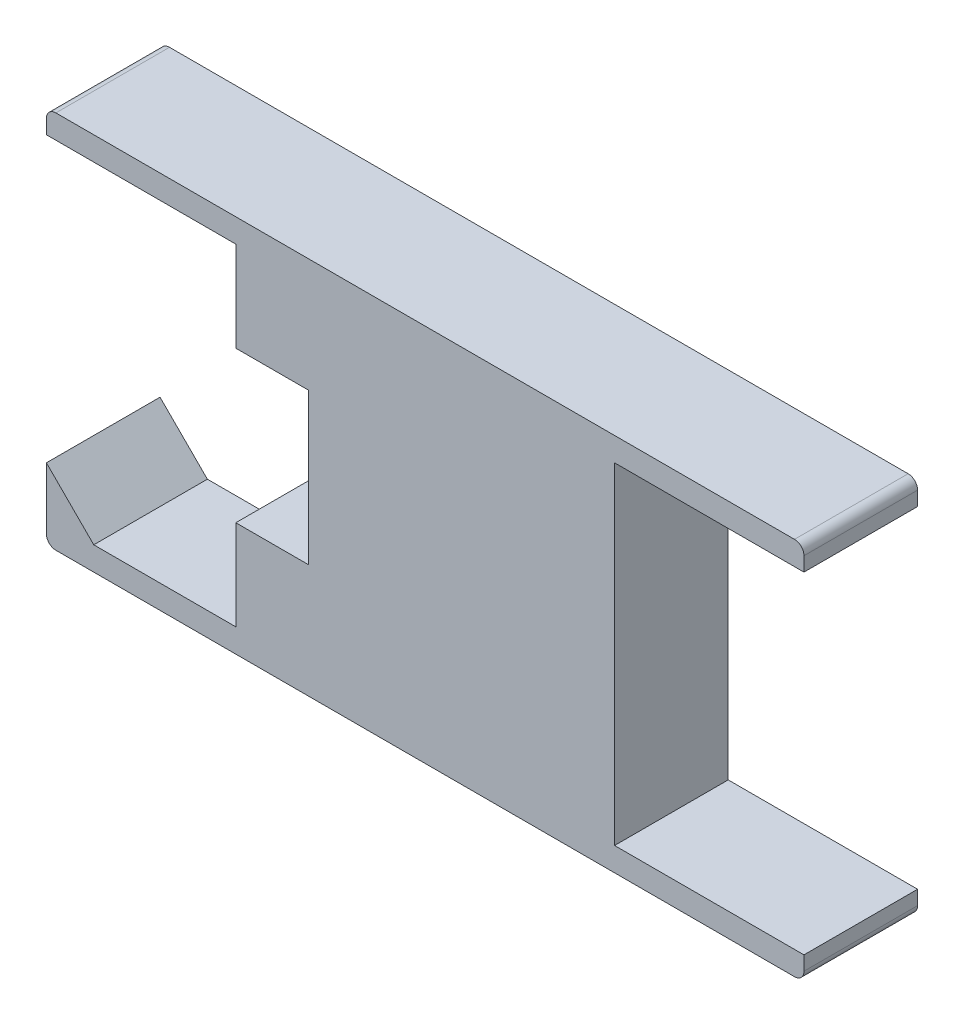
ISO-10303-21;
HEADER;
FILE_DESCRIPTION(('STEP AP214'),'2;1');
FILE_NAME('part.step','',(''),(''),'','','');
FILE_SCHEMA(('AUTOMOTIVE_DESIGN { 1 0 10303 214 1 1 1 1 }'));
ENDSEC;
DATA;
#1=APPLICATION_CONTEXT('core data for automotive mechanical design processes');
#2=APPLICATION_PROTOCOL_DEFINITION('international standard','automotive_design',2000,#1);
#3=PRODUCT_CONTEXT('',#1,'mechanical');
#4=PRODUCT('Part','Part','',(#3));
#5=PRODUCT_RELATED_PRODUCT_CATEGORY('part','',(#4));
#6=PRODUCT_DEFINITION_FORMATION('','',#4);
#7=PRODUCT_DEFINITION_CONTEXT('part definition',#1,'design');
#8=PRODUCT_DEFINITION('design','',#6,#7);
#9=PRODUCT_DEFINITION_SHAPE('','',#8);
#10=(LENGTH_UNIT() NAMED_UNIT(*) SI_UNIT(.MILLI.,.METRE.));
#11=(NAMED_UNIT(*) PLANE_ANGLE_UNIT() SI_UNIT($,.RADIAN.));
#12=(NAMED_UNIT(*) SI_UNIT($,.STERADIAN.) SOLID_ANGLE_UNIT());
#13=UNCERTAINTY_MEASURE_WITH_UNIT(LENGTH_MEASURE(1.E-05),#10,'distance_accuracy_value','');
#14=(GEOMETRIC_REPRESENTATION_CONTEXT(3) GLOBAL_UNCERTAINTY_ASSIGNED_CONTEXT((#13)) GLOBAL_UNIT_ASSIGNED_CONTEXT((#10,
#11,#12)) REPRESENTATION_CONTEXT('',''));
#15=CARTESIAN_POINT('',(0.,0.,0.));
#16=DIRECTION('',(0.,0.,1.));
#17=DIRECTION('',(1.,0.,0.));
#18=AXIS2_PLACEMENT_3D('',#15,#16,#17);
#19=CARTESIAN_POINT('',(0.78,-0.38,0.));
#20=DIRECTION('',(0.,0.,1.));
#21=DIRECTION('',(0.707106781186548,-0.707106781186548,0.));
#22=AXIS2_PLACEMENT_3D('',#19,#20,#21);
#23=CYLINDRICAL_SURFACE('',#22,0.02);
#24=CARTESIAN_POINT('',(0.78,-0.38,0.26));
#25=DIRECTION('',(0.,0.,-1.));
#26=DIRECTION('',(0.707106781186548,-0.707106781186548,0.));
#27=AXIS2_PLACEMENT_3D('',#24,#25,#26);
#28=CIRCLE('',#27,0.02);
#29=CARTESIAN_POINT('',(0.8,-0.38,0.26));
#30=VERTEX_POINT('',#29);
#31=CARTESIAN_POINT('',(0.78,-0.4,0.26));
#32=VERTEX_POINT('',#31);
#33=EDGE_CURVE('E11',#30,#32,#28,.T.);
#34=ORIENTED_EDGE('',*,*,#33,.T.);
#35=DIRECTION('',(0.,0.,-1.));
#36=VECTOR('',#35,1.);
#37=CARTESIAN_POINT('',(0.78,-0.4,0.));
#38=LINE('',#37,#36);
#39=CARTESIAN_POINT('',(0.78,-0.4,0.02));
#40=VERTEX_POINT('',#39);
#41=EDGE_CURVE('E27',#32,#40,#38,.T.);
#42=ORIENTED_EDGE('',*,*,#41,.T.);
#43=CARTESIAN_POINT('',(0.78,-0.38,0.02));
#44=DIRECTION('',(0.,0.,1.));
#45=DIRECTION('',(0.707106781186548,-0.707106781186548,0.));
#46=AXIS2_PLACEMENT_3D('',#43,#44,#45);
#47=CIRCLE('',#46,0.02);
#48=CARTESIAN_POINT('',(0.8,-0.38,0.02));
#49=VERTEX_POINT('',#48);
#50=EDGE_CURVE('E256',#40,#49,#47,.T.);
#51=ORIENTED_EDGE('',*,*,#50,.T.);
#52=DIRECTION('',(0.,0.,1.));
#53=VECTOR('',#52,1.);
#54=CARTESIAN_POINT('',(0.8,-0.38,0.));
#55=LINE('',#54,#53);
#56=EDGE_CURVE('E253',#49,#30,#55,.T.);
#57=ORIENTED_EDGE('',*,*,#56,.T.);
#58=EDGE_LOOP('',(#34,#42,#51,#57));
#59=FACE_BOUND('',#58,.T.);
#60=ADVANCED_FACE('F16',(#59),#23,.T.);
#61=CARTESIAN_POINT('',(-0.8,-0.4,0.));
#62=DIRECTION('',(0.,-1.,0.));
#63=DIRECTION('',(0.,0.,-1.));
#64=AXIS2_PLACEMENT_3D('',#61,#62,#63);
#65=PLANE('',#64);
#66=ORIENTED_EDGE('',*,*,#41,.F.);
#67=DIRECTION('',(-1.,0.,0.));
#68=VECTOR('',#67,1.);
#69=CARTESIAN_POINT('',(-0.4,-0.4,0.26));
#70=LINE('',#69,#68);
#71=CARTESIAN_POINT('',(-0.78,-0.4,0.26));
#72=VERTEX_POINT('',#71);
#73=EDGE_CURVE('E234',#32,#72,#70,.T.);
#74=ORIENTED_EDGE('',*,*,#73,.T.);
#75=DIRECTION('',(0.,0.,1.));
#76=VECTOR('',#75,1.);
#77=CARTESIAN_POINT('',(-0.78,-0.4,0.));
#78=LINE('',#77,#76);
#79=CARTESIAN_POINT('',(-0.78,-0.4,0.02));
#80=VERTEX_POINT('',#79);
#81=EDGE_CURVE('E388',#80,#72,#78,.T.);
#82=ORIENTED_EDGE('',*,*,#81,.F.);
#83=DIRECTION('',(1.,0.,0.));
#84=VECTOR('',#83,1.);
#85=CARTESIAN_POINT('',(-0.4,-0.4,0.02));
#86=LINE('',#85,#84);
#87=EDGE_CURVE('E231',#80,#40,#86,.T.);
#88=ORIENTED_EDGE('',*,*,#87,.T.);
#89=EDGE_LOOP('',(#66,#74,#82,#88));
#90=FACE_BOUND('',#89,.T.);
#91=ADVANCED_FACE('F847',(#90),#65,.T.);
#92=CARTESIAN_POINT('',(0.,0.,0.26));
#93=DIRECTION('',(0.,0.,-1.));
#94=DIRECTION('',(0.,-1.,0.));
#95=AXIS2_PLACEMENT_3D('',#92,#93,#94);
#96=PLANE('',#95);
#97=ORIENTED_EDGE('',*,*,#33,.F.);
#98=DIRECTION('',(0.,-1.,0.));
#99=VECTOR('',#98,1.);
#100=CARTESIAN_POINT('',(0.8,-0.2,0.26));
#101=LINE('',#100,#99);
#102=CARTESIAN_POINT('',(0.8,-0.35,0.26));
#103=VERTEX_POINT('',#102);
#104=EDGE_CURVE('E357',#103,#30,#101,.T.);
#105=ORIENTED_EDGE('',*,*,#104,.F.);
#106=DIRECTION('',(1.,0.,0.));
#107=VECTOR('',#106,1.);
#108=CARTESIAN_POINT('',(0.4,-0.35,0.26));
#109=LINE('',#108,#107);
#110=CARTESIAN_POINT('',(0.4,-0.35,0.26));
#111=VERTEX_POINT('',#110);
#112=EDGE_CURVE('E252',#111,#103,#109,.T.);
#113=ORIENTED_EDGE('',*,*,#112,.F.);
#114=DIRECTION('',(0.,-1.,0.));
#115=VECTOR('',#114,1.);
#116=CARTESIAN_POINT('',(0.4,-0.175,0.26));
#117=LINE('',#116,#115);
#118=CARTESIAN_POINT('',(0.4,0.35,0.26));
#119=VERTEX_POINT('',#118);
#120=EDGE_CURVE('E265',#119,#111,#117,.T.);
#121=ORIENTED_EDGE('',*,*,#120,.F.);
#122=DIRECTION('',(-1.,0.,0.));
#123=VECTOR('',#122,1.);
#124=CARTESIAN_POINT('',(0.2,0.35,0.26));
#125=LINE('',#124,#123);
#126=CARTESIAN_POINT('',(0.8,0.35,0.26));
#127=VERTEX_POINT('',#126);
#128=EDGE_CURVE('E311',#127,#119,#125,.T.);
#129=ORIENTED_EDGE('',*,*,#128,.F.);
#130=DIRECTION('',(0.,-1.,0.));
#131=VECTOR('',#130,1.);
#132=CARTESIAN_POINT('',(0.8,-0.2,0.26));
#133=LINE('',#132,#131);
#134=CARTESIAN_POINT('',(0.8,0.38,0.26));
#135=VERTEX_POINT('',#134);
#136=EDGE_CURVE('E287',#135,#127,#133,.T.);
#137=ORIENTED_EDGE('',*,*,#136,.F.);
#138=CARTESIAN_POINT('',(0.78,0.38,0.26));
#139=DIRECTION('',(0.,0.,-1.));
#140=DIRECTION('',(0.707106781186548,0.707106781186548,0.));
#141=AXIS2_PLACEMENT_3D('',#138,#139,#140);
#142=CIRCLE('',#141,0.02);
#143=CARTESIAN_POINT('',(0.78,0.4,0.26));
#144=VERTEX_POINT('',#143);
#145=EDGE_CURVE('E235',#144,#135,#142,.T.);
#146=ORIENTED_EDGE('',*,*,#145,.F.);
#147=DIRECTION('',(1.,0.,0.));
#148=VECTOR('',#147,1.);
#149=CARTESIAN_POINT('',(0.4,0.4,0.26));
#150=LINE('',#149,#148);
#151=CARTESIAN_POINT('',(-0.78,0.4,0.26));
#152=VERTEX_POINT('',#151);
#153=EDGE_CURVE('E369',#152,#144,#150,.T.);
#154=ORIENTED_EDGE('',*,*,#153,.F.);
#155=CARTESIAN_POINT('',(-0.78,0.38,0.26));
#156=DIRECTION('',(0.,0.,-1.));
#157=DIRECTION('',(-0.707106781186548,0.707106781186548,0.));
#158=AXIS2_PLACEMENT_3D('',#155,#156,#157);
#159=CIRCLE('',#158,0.02);
#160=CARTESIAN_POINT('',(-0.8,0.38,0.26));
#161=VERTEX_POINT('',#160);
#162=EDGE_CURVE('E372',#161,#152,#159,.T.);
#163=ORIENTED_EDGE('',*,*,#162,.F.);
#164=DIRECTION('',(0.,1.,0.));
#165=VECTOR('',#164,1.);
#166=CARTESIAN_POINT('',(-0.8,0.2,0.26));
#167=LINE('',#166,#165);
#168=CARTESIAN_POINT('',(-0.8,0.35,0.26));
#169=VERTEX_POINT('',#168);
#170=EDGE_CURVE('E204',#169,#161,#167,.T.);
#171=ORIENTED_EDGE('',*,*,#170,.F.);
#172=DIRECTION('',(-1.,0.,0.));
#173=VECTOR('',#172,1.);
#174=CARTESIAN_POINT('',(-0.4,0.35,0.26));
#175=LINE('',#174,#173);
#176=CARTESIAN_POINT('',(-0.4,0.35,0.26));
#177=VERTEX_POINT('',#176);
#178=EDGE_CURVE('E243',#177,#169,#175,.T.);
#179=ORIENTED_EDGE('',*,*,#178,.F.);
#180=DIRECTION('',(0.,1.,0.));
#181=VECTOR('',#180,1.);
#182=CARTESIAN_POINT('',(-0.4,0.175,0.26));
#183=LINE('',#182,#181);
#184=CARTESIAN_POINT('',(-0.4,0.159603540156,0.26));
#185=VERTEX_POINT('',#184);
#186=EDGE_CURVE('E299',#185,#177,#183,.T.);
#187=ORIENTED_EDGE('',*,*,#186,.F.);
#188=DIRECTION('',(-1.,0.,0.));
#189=VECTOR('',#188,1.);
#190=CARTESIAN_POINT('',(-0.2,0.159603540156,0.26));
#191=LINE('',#190,#189);
#192=CARTESIAN_POINT('',(-0.246794344933,0.159603540156,0.26));
#193=VERTEX_POINT('',#192);
#194=EDGE_CURVE('E326',#193,#185,#191,.T.);
#195=ORIENTED_EDGE('',*,*,#194,.F.);
#196=DIRECTION('',(0.,1.,0.));
#197=VECTOR('',#196,1.);
#198=CARTESIAN_POINT('',(-0.246794344933,0.07980177007817,0.26));
#199=LINE('',#198,#197);
#200=CARTESIAN_POINT('',(-0.246794344933,-0.159603540156,0.26));
#201=VERTEX_POINT('',#200);
#202=EDGE_CURVE('E306',#201,#193,#199,.T.);
#203=ORIENTED_EDGE('',*,*,#202,.F.);
#204=DIRECTION('',(1.,0.,0.));
#205=VECTOR('',#204,1.);
#206=CARTESIAN_POINT('',(-0.123397172466,-0.159603540156,0.26));
#207=LINE('',#206,#205);
#208=CARTESIAN_POINT('',(-0.4,-0.159603540156,0.26));
#209=VERTEX_POINT('',#208);
#210=EDGE_CURVE('E248',#209,#201,#207,.T.);
#211=ORIENTED_EDGE('',*,*,#210,.F.);
#212=DIRECTION('',(0.,1.,0.));
#213=VECTOR('',#212,1.);
#214=CARTESIAN_POINT('',(-0.4,-0.07980177007817,0.26));
#215=LINE('',#214,#213);
#216=CARTESIAN_POINT('',(-0.4,-0.35,0.26));
#217=VERTEX_POINT('',#216);
#218=EDGE_CURVE('E216',#217,#209,#215,.T.);
#219=ORIENTED_EDGE('',*,*,#218,.F.);
#220=DIRECTION('',(1.,0.,0.));
#221=VECTOR('',#220,1.);
#222=CARTESIAN_POINT('',(-0.2,-0.35,0.26));
#223=LINE('',#222,#221);
#224=CARTESIAN_POINT('',(-0.7,-0.35,0.26));
#225=VERTEX_POINT('',#224);
#226=EDGE_CURVE('E215',#225,#217,#223,.T.);
#227=ORIENTED_EDGE('',*,*,#226,.F.);
#228=DIRECTION('',(0.707106781186548,-0.707106781186548,0.));
#229=VECTOR('',#228,1.);
#230=CARTESIAN_POINT('',(-0.6125,-0.4375,0.26));
#231=LINE('',#230,#229);
#232=CARTESIAN_POINT('',(-0.8,-0.25,0.26));
#233=VERTEX_POINT('',#232);
#234=EDGE_CURVE('E211',#233,#225,#231,.T.);
#235=ORIENTED_EDGE('',*,*,#234,.F.);
#236=DIRECTION('',(0.,1.,0.));
#237=VECTOR('',#236,1.);
#238=CARTESIAN_POINT('',(-0.8,0.2,0.26));
#239=LINE('',#238,#237);
#240=CARTESIAN_POINT('',(-0.8,-0.38,0.26));
#241=VERTEX_POINT('',#240);
#242=EDGE_CURVE('E391',#241,#233,#239,.T.);
#243=ORIENTED_EDGE('',*,*,#242,.F.);
#244=CARTESIAN_POINT('',(-0.78,-0.38,0.26));
#245=DIRECTION('',(0.,0.,-1.));
#246=DIRECTION('',(-0.707106781186548,-0.707106781186548,0.));
#247=AXIS2_PLACEMENT_3D('',#244,#245,#246);
#248=CIRCLE('',#247,0.02);
#249=EDGE_CURVE('E300',#72,#241,#248,.T.);
#250=ORIENTED_EDGE('',*,*,#249,.F.);
#251=ORIENTED_EDGE('',*,*,#73,.F.);
#252=EDGE_LOOP('',(#97,#105,#113,#121,#129,#137,#146,#154,#163,#171,#179,#187,#195,#203,#211,
#219,#227,#235,#243,#250,#251));
#253=FACE_BOUND('',#252,.T.);
#254=ADVANCED_FACE('F837',(#253),#96,.F.);
#255=CARTESIAN_POINT('',(0.78,0.38,0.));
#256=DIRECTION('',(0.,0.,1.));
#257=DIRECTION('',(0.707106781186548,0.707106781186548,0.));
#258=AXIS2_PLACEMENT_3D('',#255,#256,#257);
#259=CYLINDRICAL_SURFACE('',#258,0.02);
#260=ORIENTED_EDGE('',*,*,#145,.T.);
#261=DIRECTION('',(0.,0.,-1.));
#262=VECTOR('',#261,1.);
#263=CARTESIAN_POINT('',(0.8,0.38,0.));
#264=LINE('',#263,#262);
#265=CARTESIAN_POINT('',(0.8,0.38,0.02));
#266=VERTEX_POINT('',#265);
#267=EDGE_CURVE('E267',#135,#266,#264,.T.);
#268=ORIENTED_EDGE('',*,*,#267,.T.);
#269=CARTESIAN_POINT('',(0.78,0.38,0.02));
#270=DIRECTION('',(0.,0.,1.));
#271=DIRECTION('',(0.707106781186548,0.707106781186548,0.));
#272=AXIS2_PLACEMENT_3D('',#269,#270,#271);
#273=CIRCLE('',#272,0.02);
#274=CARTESIAN_POINT('',(0.78,0.4,0.02));
#275=VERTEX_POINT('',#274);
#276=EDGE_CURVE('E271',#266,#275,#273,.T.);
#277=ORIENTED_EDGE('',*,*,#276,.T.);
#278=DIRECTION('',(0.,0.,1.));
#279=VECTOR('',#278,1.);
#280=CARTESIAN_POINT('',(0.78,0.4,0.));
#281=LINE('',#280,#279);
#282=EDGE_CURVE('E334',#275,#144,#281,.T.);
#283=ORIENTED_EDGE('',*,*,#282,.T.);
#284=EDGE_LOOP('',(#260,#268,#277,#283));
#285=FACE_BOUND('',#284,.T.);
#286=ADVANCED_FACE('F827',(#285),#259,.T.);
#287=CARTESIAN_POINT('',(0.8,0.4,0.));
#288=DIRECTION('',(0.,1.,0.));
#289=DIRECTION('',(1.,0.,0.));
#290=AXIS2_PLACEMENT_3D('',#287,#288,#289);
#291=PLANE('',#290);
#292=ORIENTED_EDGE('',*,*,#282,.F.);
#293=DIRECTION('',(-1.,0.,0.));
#294=VECTOR('',#293,1.);
#295=CARTESIAN_POINT('',(0.4,0.4,0.02));
#296=LINE('',#295,#294);
#297=CARTESIAN_POINT('',(-0.78,0.4,0.02));
#298=VERTEX_POINT('',#297);
#299=EDGE_CURVE('E365',#275,#298,#296,.T.);
#300=ORIENTED_EDGE('',*,*,#299,.T.);
#301=DIRECTION('',(0.,0.,-1.));
#302=VECTOR('',#301,1.);
#303=CARTESIAN_POINT('',(-0.78,0.4,0.));
#304=LINE('',#303,#302);
#305=EDGE_CURVE('E361',#152,#298,#304,.T.);
#306=ORIENTED_EDGE('',*,*,#305,.F.);
#307=ORIENTED_EDGE('',*,*,#153,.T.);
#308=EDGE_LOOP('',(#292,#300,#306,#307));
#309=FACE_BOUND('',#308,.T.);
#310=ADVANCED_FACE('F817',(#309),#291,.T.);
#311=CARTESIAN_POINT('',(-0.78,0.38,0.));
#312=DIRECTION('',(0.,0.,1.));
#313=DIRECTION('',(-0.707106781186548,0.707106781186548,0.));
#314=AXIS2_PLACEMENT_3D('',#311,#312,#313);
#315=CYLINDRICAL_SURFACE('',#314,0.02);
#316=ORIENTED_EDGE('',*,*,#162,.T.);
#317=ORIENTED_EDGE('',*,*,#305,.T.);
#318=CARTESIAN_POINT('',(-0.78,0.38,0.02));
#319=DIRECTION('',(0.,0.,1.));
#320=DIRECTION('',(-0.707106781186548,0.707106781186548,0.));
#321=AXIS2_PLACEMENT_3D('',#318,#319,#320);
#322=CIRCLE('',#321,0.02);
#323=CARTESIAN_POINT('',(-0.8,0.38,0.02));
#324=VERTEX_POINT('',#323);
#325=EDGE_CURVE('E322',#298,#324,#322,.T.);
#326=ORIENTED_EDGE('',*,*,#325,.T.);
#327=DIRECTION('',(0.,0.,1.));
#328=VECTOR('',#327,1.);
#329=CARTESIAN_POINT('',(-0.8,0.38,0.));
#330=LINE('',#329,#328);
#331=EDGE_CURVE('E304',#324,#161,#330,.T.);
#332=ORIENTED_EDGE('',*,*,#331,.T.);
#333=EDGE_LOOP('',(#316,#317,#326,#332));
#334=FACE_BOUND('',#333,.T.);
#335=ADVANCED_FACE('F807',(#334),#315,.T.);
#336=CARTESIAN_POINT('',(-0.78,-0.38,0.));
#337=DIRECTION('',(0.,0.,1.));
#338=DIRECTION('',(-0.707106781186548,-0.707106781186548,0.));
#339=AXIS2_PLACEMENT_3D('',#336,#337,#338);
#340=CYLINDRICAL_SURFACE('',#339,0.02);
#341=ORIENTED_EDGE('',*,*,#249,.T.);
#342=DIRECTION('',(0.,0.,-1.));
#343=VECTOR('',#342,1.);
#344=CARTESIAN_POINT('',(-0.8,-0.38,0.));
#345=LINE('',#344,#343);
#346=CARTESIAN_POINT('',(-0.8,-0.38,0.02));
#347=VERTEX_POINT('',#346);
#348=EDGE_CURVE('E305',#241,#347,#345,.T.);
#349=ORIENTED_EDGE('',*,*,#348,.T.);
#350=CARTESIAN_POINT('',(-0.78,-0.38,0.02));
#351=DIRECTION('',(0.,0.,1.));
#352=DIRECTION('',(-0.707106781186548,-0.707106781186548,0.));
#353=AXIS2_PLACEMENT_3D('',#350,#351,#352);
#354=CIRCLE('',#353,0.02);
#355=EDGE_CURVE('E379',#347,#80,#354,.T.);
#356=ORIENTED_EDGE('',*,*,#355,.T.);
#357=ORIENTED_EDGE('',*,*,#81,.T.);
#358=EDGE_LOOP('',(#341,#349,#356,#357));
#359=FACE_BOUND('',#358,.T.);
#360=ADVANCED_FACE('F797',(#359),#340,.T.);
#361=CARTESIAN_POINT('',(-0.8,0.4,0.));
#362=DIRECTION('',(-1.,0.,0.));
#363=DIRECTION('',(0.,0.,1.));
#364=AXIS2_PLACEMENT_3D('',#361,#362,#363);
#365=PLANE('',#364);
#366=ORIENTED_EDGE('',*,*,#348,.F.);
#367=ORIENTED_EDGE('',*,*,#242,.T.);
#368=DIRECTION('',(0.,0.,-1.));
#369=VECTOR('',#368,1.);
#370=CARTESIAN_POINT('',(-0.8,-0.25,0.));
#371=LINE('',#370,#369);
#372=CARTESIAN_POINT('',(-0.8,-0.25,0.02));
#373=VERTEX_POINT('',#372);
#374=EDGE_CURVE('E251',#233,#373,#371,.T.);
#375=ORIENTED_EDGE('',*,*,#374,.T.);
#376=DIRECTION('',(0.,-1.,0.));
#377=VECTOR('',#376,1.);
#378=CARTESIAN_POINT('',(-0.8,0.2,0.02));
#379=LINE('',#378,#377);
#380=EDGE_CURVE('E199',#373,#347,#379,.T.);
#381=ORIENTED_EDGE('',*,*,#380,.T.);
#382=EDGE_LOOP('',(#366,#367,#375,#381));
#383=FACE_BOUND('',#382,.T.);
#384=ADVANCED_FACE('F787',(#383),#365,.T.);
#385=CARTESIAN_POINT('',(0.8,-0.35,0.));
#386=DIRECTION('',(0.,-1.,0.));
#387=DIRECTION('',(0.,0.,-1.));
#388=AXIS2_PLACEMENT_3D('',#385,#386,#387);
#389=PLANE('',#388);
#390=ORIENTED_EDGE('',*,*,#112,.T.);
#391=DIRECTION('',(0.,0.,1.));
#392=VECTOR('',#391,1.);
#393=CARTESIAN_POINT('',(0.8,-0.35,0.));
#394=LINE('',#393,#392);
#395=CARTESIAN_POINT('',(0.8,-0.35,0.02));
#396=VERTEX_POINT('',#395);
#397=EDGE_CURVE('E277',#396,#103,#394,.T.);
#398=ORIENTED_EDGE('',*,*,#397,.F.);
#399=DIRECTION('',(1.,0.,0.));
#400=VECTOR('',#399,1.);
#401=CARTESIAN_POINT('',(0.8,-0.35,0.02));
#402=LINE('',#401,#400);
#403=CARTESIAN_POINT('',(0.4,-0.35,0.02));
#404=VERTEX_POINT('',#403);
#405=EDGE_CURVE('E375',#404,#396,#402,.T.);
#406=ORIENTED_EDGE('',*,*,#405,.F.);
#407=DIRECTION('',(0.,0.,-1.));
#408=VECTOR('',#407,1.);
#409=CARTESIAN_POINT('',(0.4,-0.35,0.));
#410=LINE('',#409,#408);
#411=EDGE_CURVE('E261',#111,#404,#410,.T.);
#412=ORIENTED_EDGE('',*,*,#411,.F.);
#413=EDGE_LOOP('',(#390,#398,#406,#412));
#414=FACE_BOUND('',#413,.T.);
#415=ADVANCED_FACE('F777',(#414),#389,.F.);
#416=CARTESIAN_POINT('',(0.8,-0.4,0.));
#417=DIRECTION('',(1.,0.,0.));
#418=DIRECTION('',(0.,1.,0.));
#419=AXIS2_PLACEMENT_3D('',#416,#417,#418);
#420=PLANE('',#419);
#421=ORIENTED_EDGE('',*,*,#56,.F.);
#422=DIRECTION('',(0.,1.,0.));
#423=VECTOR('',#422,1.);
#424=CARTESIAN_POINT('',(0.8,-0.2,0.02));
#425=LINE('',#424,#423);
#426=EDGE_CURVE('E274',#49,#396,#425,.T.);
#427=ORIENTED_EDGE('',*,*,#426,.T.);
#428=ORIENTED_EDGE('',*,*,#397,.T.);
#429=ORIENTED_EDGE('',*,*,#104,.T.);
#430=EDGE_LOOP('',(#421,#427,#428,#429));
#431=FACE_BOUND('',#430,.T.);
#432=ADVANCED_FACE('F768',(#431),#420,.T.);
#433=CARTESIAN_POINT('',(-0.7,-0.35,0.));
#434=DIRECTION('',(-0.707106781186548,-0.707106781186548,0.));
#435=DIRECTION('',(-0.707106781186548,0.707106781186548,0.));
#436=AXIS2_PLACEMENT_3D('',#433,#434,#435);
#437=PLANE('',#436);
#438=ORIENTED_EDGE('',*,*,#234,.T.);
#439=DIRECTION('',(0.,0.,1.));
#440=VECTOR('',#439,1.);
#441=CARTESIAN_POINT('',(-0.7,-0.35,0.));
#442=LINE('',#441,#440);
#443=CARTESIAN_POINT('',(-0.7,-0.35,0.02));
#444=VERTEX_POINT('',#443);
#445=EDGE_CURVE('E208',#444,#225,#442,.T.);
#446=ORIENTED_EDGE('',*,*,#445,.F.);
#447=DIRECTION('',(0.707106781186548,-0.707106781186548,0.));
#448=VECTOR('',#447,1.);
#449=CARTESIAN_POINT('',(-0.6375,-0.4125,0.02));
#450=LINE('',#449,#448);
#451=EDGE_CURVE('E192',#373,#444,#450,.T.);
#452=ORIENTED_EDGE('',*,*,#451,.F.);
#453=ORIENTED_EDGE('',*,*,#374,.F.);
#454=EDGE_LOOP('',(#438,#446,#452,#453));
#455=FACE_BOUND('',#454,.T.);
#456=ADVANCED_FACE('F209',(#455),#437,.F.);
#457=CARTESIAN_POINT('',(-0.4,-0.35,0.));
#458=DIRECTION('',(0.,-1.,0.));
#459=DIRECTION('',(-1.,0.,0.));
#460=AXIS2_PLACEMENT_3D('',#457,#458,#459);
#461=PLANE('',#460);
#462=ORIENTED_EDGE('',*,*,#226,.T.);
#463=DIRECTION('',(0.,0.,1.));
#464=VECTOR('',#463,1.);
#465=CARTESIAN_POINT('',(-0.4,-0.35,0.));
#466=LINE('',#465,#464);
#467=CARTESIAN_POINT('',(-0.4,-0.35,0.02));
#468=VERTEX_POINT('',#467);
#469=EDGE_CURVE('E220',#468,#217,#466,.T.);
#470=ORIENTED_EDGE('',*,*,#469,.F.);
#471=DIRECTION('',(1.,0.,0.));
#472=VECTOR('',#471,1.);
#473=CARTESIAN_POINT('',(0.8,-0.35,0.02));
#474=LINE('',#473,#472);
#475=EDGE_CURVE('E196',#444,#468,#474,.T.);
#476=ORIENTED_EDGE('',*,*,#475,.F.);
#477=ORIENTED_EDGE('',*,*,#445,.T.);
#478=EDGE_LOOP('',(#462,#470,#476,#477));
#479=FACE_BOUND('',#478,.T.);
#480=ADVANCED_FACE('F218',(#479),#461,.F.);
#481=CARTESIAN_POINT('',(-0.4,-0.159603540156,0.));
#482=DIRECTION('',(1.,0.,0.));
#483=DIRECTION('',(0.,1.,0.));
#484=AXIS2_PLACEMENT_3D('',#481,#482,#483);
#485=PLANE('',#484);
#486=ORIENTED_EDGE('',*,*,#218,.T.);
#487=DIRECTION('',(0.,0.,-1.));
#488=VECTOR('',#487,1.);
#489=CARTESIAN_POINT('',(-0.4,-0.159603540156,0.));
#490=LINE('',#489,#488);
#491=CARTESIAN_POINT('',(-0.4,-0.159603540156,0.02));
#492=VERTEX_POINT('',#491);
#493=EDGE_CURVE('E260',#209,#492,#490,.T.);
#494=ORIENTED_EDGE('',*,*,#493,.T.);
#495=DIRECTION('',(0.,-1.,0.));
#496=VECTOR('',#495,1.);
#497=CARTESIAN_POINT('',(-0.4,-0.503670619885,0.02));
#498=LINE('',#497,#496);
#499=EDGE_CURVE('E247',#492,#468,#498,.T.);
#500=ORIENTED_EDGE('',*,*,#499,.T.);
#501=ORIENTED_EDGE('',*,*,#469,.T.);
#502=EDGE_LOOP('',(#486,#494,#500,#501));
#503=FACE_BOUND('',#502,.T.);
#504=ADVANCED_FACE('F739',(#503),#485,.F.);
#505=CARTESIAN_POINT('',(-0.246794344933,-0.159603540156,0.));
#506=DIRECTION('',(0.,-1.,0.));
#507=DIRECTION('',(0.,0.,-1.));
#508=AXIS2_PLACEMENT_3D('',#505,#506,#507);
#509=PLANE('',#508);
#510=ORIENTED_EDGE('',*,*,#210,.T.);
#511=DIRECTION('',(0.,0.,1.));
#512=VECTOR('',#511,1.);
#513=CARTESIAN_POINT('',(-0.246794344933,-0.159603540156,0.));
#514=LINE('',#513,#512);
#515=CARTESIAN_POINT('',(-0.246794344933,-0.159603540156,0.02));
#516=VERTEX_POINT('',#515);
#517=EDGE_CURVE('E310',#516,#201,#514,.T.);
#518=ORIENTED_EDGE('',*,*,#517,.F.);
#519=DIRECTION('',(1.,0.,0.));
#520=VECTOR('',#519,1.);
#521=CARTESIAN_POINT('',(-0.276602827534,-0.159603540156,0.02));
#522=LINE('',#521,#520);
#523=EDGE_CURVE('E223',#492,#516,#522,.T.);
#524=ORIENTED_EDGE('',*,*,#523,.F.);
#525=ORIENTED_EDGE('',*,*,#493,.F.);
#526=EDGE_LOOP('',(#510,#518,#524,#525));
#527=FACE_BOUND('',#526,.T.);
#528=ADVANCED_FACE('F727',(#527),#509,.F.);
#529=CARTESIAN_POINT('',(0.4,0.35,0.));
#530=DIRECTION('',(0.,1.,0.));
#531=DIRECTION('',(1.,0.,0.));
#532=AXIS2_PLACEMENT_3D('',#529,#530,#531);
#533=PLANE('',#532);
#534=ORIENTED_EDGE('',*,*,#128,.T.);
#535=DIRECTION('',(0.,0.,1.));
#536=VECTOR('',#535,1.);
#537=CARTESIAN_POINT('',(0.4,0.35,0.));
#538=LINE('',#537,#536);
#539=CARTESIAN_POINT('',(0.4,0.35,0.02));
#540=VERTEX_POINT('',#539);
#541=EDGE_CURVE('E349',#540,#119,#538,.T.);
#542=ORIENTED_EDGE('',*,*,#541,.F.);
#543=DIRECTION('',(1.,0.,0.));
#544=VECTOR('',#543,1.);
#545=CARTESIAN_POINT('',(0.8,0.35,0.02));
#546=LINE('',#545,#544);
#547=CARTESIAN_POINT('',(0.8,0.35,0.02));
#548=VERTEX_POINT('',#547);
#549=EDGE_CURVE('E315',#540,#548,#546,.T.);
#550=ORIENTED_EDGE('',*,*,#549,.T.);
#551=DIRECTION('',(0.,0.,-1.));
#552=VECTOR('',#551,1.);
#553=CARTESIAN_POINT('',(0.8,0.35,0.));
#554=LINE('',#553,#552);
#555=EDGE_CURVE('E319',#127,#548,#554,.T.);
#556=ORIENTED_EDGE('',*,*,#555,.F.);
#557=EDGE_LOOP('',(#534,#542,#550,#556));
#558=FACE_BOUND('',#557,.T.);
#559=ADVANCED_FACE('F714',(#558),#533,.F.);
#560=CARTESIAN_POINT('',(0.4,-0.35,0.));
#561=DIRECTION('',(-1.,0.,0.));
#562=DIRECTION('',(0.,0.,1.));
#563=AXIS2_PLACEMENT_3D('',#560,#561,#562);
#564=PLANE('',#563);
#565=ORIENTED_EDGE('',*,*,#120,.T.);
#566=ORIENTED_EDGE('',*,*,#411,.T.);
#567=DIRECTION('',(0.,1.,0.));
#568=VECTOR('',#567,1.);
#569=CARTESIAN_POINT('',(0.4,0.503670619885,0.02));
#570=LINE('',#569,#568);
#571=EDGE_CURVE('E266',#404,#540,#570,.T.);
#572=ORIENTED_EDGE('',*,*,#571,.T.);
#573=ORIENTED_EDGE('',*,*,#541,.T.);
#574=EDGE_LOOP('',(#565,#566,#572,#573));
#575=FACE_BOUND('',#574,.T.);
#576=ADVANCED_FACE('F703',(#575),#564,.F.);
#577=CARTESIAN_POINT('',(-0.8,0.35,0.));
#578=DIRECTION('',(0.,1.,0.));
#579=DIRECTION('',(1.,0.,0.));
#580=AXIS2_PLACEMENT_3D('',#577,#578,#579);
#581=PLANE('',#580);
#582=ORIENTED_EDGE('',*,*,#178,.T.);
#583=DIRECTION('',(0.,0.,1.));
#584=VECTOR('',#583,1.);
#585=CARTESIAN_POINT('',(-0.8,0.35,0.));
#586=LINE('',#585,#584);
#587=CARTESIAN_POINT('',(-0.8,0.35,0.02));
#588=VERTEX_POINT('',#587);
#589=EDGE_CURVE('E238',#588,#169,#586,.T.);
#590=ORIENTED_EDGE('',*,*,#589,.F.);
#591=DIRECTION('',(1.,0.,0.));
#592=VECTOR('',#591,1.);
#593=CARTESIAN_POINT('',(0.8,0.35,0.02));
#594=LINE('',#593,#592);
#595=CARTESIAN_POINT('',(-0.4,0.35,0.02));
#596=VERTEX_POINT('',#595);
#597=EDGE_CURVE('E239',#588,#596,#594,.T.);
#598=ORIENTED_EDGE('',*,*,#597,.T.);
#599=DIRECTION('',(0.,0.,1.));
#600=VECTOR('',#599,1.);
#601=CARTESIAN_POINT('',(-0.4,0.35,0.));
#602=LINE('',#601,#600);
#603=EDGE_CURVE('E244',#596,#177,#602,.T.);
#604=ORIENTED_EDGE('',*,*,#603,.T.);
#605=EDGE_LOOP('',(#582,#590,#598,#604));
#606=FACE_BOUND('',#605,.T.);
#607=ADVANCED_FACE('F434',(#606),#581,.F.);
#608=CARTESIAN_POINT('',(-0.246794344933,0.159603540156,0.));
#609=DIRECTION('',(1.,0.,0.));
#610=DIRECTION('',(0.,1.,0.));
#611=AXIS2_PLACEMENT_3D('',#608,#609,#610);
#612=PLANE('',#611);
#613=ORIENTED_EDGE('',*,*,#202,.T.);
#614=DIRECTION('',(0.,0.,1.));
#615=VECTOR('',#614,1.);
#616=CARTESIAN_POINT('',(-0.246794344933,0.159603540156,0.));
#617=LINE('',#616,#615);
#618=CARTESIAN_POINT('',(-0.246794344933,0.159603540156,0.02));
#619=VERTEX_POINT('',#618);
#620=EDGE_CURVE('E330',#619,#193,#617,.T.);
#621=ORIENTED_EDGE('',*,*,#620,.F.);
#622=DIRECTION('',(0.,1.,0.));
#623=VECTOR('',#622,1.);
#624=CARTESIAN_POINT('',(-0.246794344933,-0.07980177007817,0.02));
#625=LINE('',#624,#623);
#626=EDGE_CURVE('E228',#516,#619,#625,.T.);
#627=ORIENTED_EDGE('',*,*,#626,.F.);
#628=ORIENTED_EDGE('',*,*,#517,.T.);
#629=EDGE_LOOP('',(#613,#621,#627,#628));
#630=FACE_BOUND('',#629,.T.);
#631=ADVANCED_FACE('F682',(#630),#612,.F.);
#632=CARTESIAN_POINT('',(-0.4,0.159603540156,0.));
#633=DIRECTION('',(0.,1.,0.));
#634=DIRECTION('',(1.,0.,0.));
#635=AXIS2_PLACEMENT_3D('',#632,#633,#634);
#636=PLANE('',#635);
#637=ORIENTED_EDGE('',*,*,#194,.T.);
#638=DIRECTION('',(0.,0.,1.));
#639=VECTOR('',#638,1.);
#640=CARTESIAN_POINT('',(-0.4,0.159603540156,0.));
#641=LINE('',#640,#639);
#642=CARTESIAN_POINT('',(-0.4,0.159603540156,0.02));
#643=VERTEX_POINT('',#642);
#644=EDGE_CURVE('E282',#643,#185,#641,.T.);
#645=ORIENTED_EDGE('',*,*,#644,.F.);
#646=DIRECTION('',(-1.,0.,0.));
#647=VECTOR('',#646,1.);
#648=CARTESIAN_POINT('',(-0.123397172466,0.159603540156,0.02));
#649=LINE('',#648,#647);
#650=EDGE_CURVE('E281',#619,#643,#649,.T.);
#651=ORIENTED_EDGE('',*,*,#650,.F.);
#652=ORIENTED_EDGE('',*,*,#620,.T.);
#653=EDGE_LOOP('',(#637,#645,#651,#652));
#654=FACE_BOUND('',#653,.T.);
#655=ADVANCED_FACE('F669',(#654),#636,.F.);
#656=CARTESIAN_POINT('',(-0.4,0.35,0.));
#657=DIRECTION('',(1.,0.,0.));
#658=DIRECTION('',(0.,1.,0.));
#659=AXIS2_PLACEMENT_3D('',#656,#657,#658);
#660=PLANE('',#659);
#661=ORIENTED_EDGE('',*,*,#186,.T.);
#662=ORIENTED_EDGE('',*,*,#603,.F.);
#663=DIRECTION('',(0.,-1.,0.));
#664=VECTOR('',#663,1.);
#665=CARTESIAN_POINT('',(-0.4,-0.503670619885,0.02));
#666=LINE('',#665,#664);
#667=EDGE_CURVE('E286',#596,#643,#666,.T.);
#668=ORIENTED_EDGE('',*,*,#667,.T.);
#669=ORIENTED_EDGE('',*,*,#644,.T.);
#670=EDGE_LOOP('',(#661,#662,#668,#669));
#671=FACE_BOUND('',#670,.T.);
#672=ADVANCED_FACE('F657',(#671),#660,.F.);
#673=CARTESIAN_POINT('',(0.8,-0.4,0.));
#674=DIRECTION('',(1.,0.,0.));
#675=DIRECTION('',(0.,1.,0.));
#676=AXIS2_PLACEMENT_3D('',#673,#674,#675);
#677=PLANE('',#676);
#678=ORIENTED_EDGE('',*,*,#267,.F.);
#679=ORIENTED_EDGE('',*,*,#136,.T.);
#680=ORIENTED_EDGE('',*,*,#555,.T.);
#681=DIRECTION('',(0.,1.,0.));
#682=VECTOR('',#681,1.);
#683=CARTESIAN_POINT('',(0.8,-0.2,0.02));
#684=LINE('',#683,#682);
#685=EDGE_CURVE('E342',#548,#266,#684,.T.);
#686=ORIENTED_EDGE('',*,*,#685,.T.);
#687=EDGE_LOOP('',(#678,#679,#680,#686));
#688=FACE_BOUND('',#687,.T.);
#689=ADVANCED_FACE('F647',(#688),#677,.T.);
#690=CARTESIAN_POINT('',(-0.8,0.4,0.));
#691=DIRECTION('',(-1.,0.,0.));
#692=DIRECTION('',(0.,0.,1.));
#693=AXIS2_PLACEMENT_3D('',#690,#691,#692);
#694=PLANE('',#693);
#695=ORIENTED_EDGE('',*,*,#331,.F.);
#696=DIRECTION('',(0.,-1.,0.));
#697=VECTOR('',#696,1.);
#698=CARTESIAN_POINT('',(-0.8,0.2,0.02));
#699=LINE('',#698,#697);
#700=EDGE_CURVE('E20',#324,#588,#699,.T.);
#701=ORIENTED_EDGE('',*,*,#700,.T.);
#702=ORIENTED_EDGE('',*,*,#589,.T.);
#703=ORIENTED_EDGE('',*,*,#170,.T.);
#704=EDGE_LOOP('',(#695,#701,#702,#703));
#705=FACE_BOUND('',#704,.T.);
#706=ADVANCED_FACE('F18',(#705),#694,.T.);
#707=CARTESIAN_POINT('',(0.,0.,0.02));
#708=DIRECTION('',(0.,0.,1.));
#709=DIRECTION('',(1.,0.,0.));
#710=AXIS2_PLACEMENT_3D('',#707,#708,#709);
#711=PLANE('',#710);
#712=ORIENTED_EDGE('',*,*,#50,.F.);
#713=ORIENTED_EDGE('',*,*,#87,.F.);
#714=ORIENTED_EDGE('',*,*,#355,.F.);
#715=ORIENTED_EDGE('',*,*,#380,.F.);
#716=ORIENTED_EDGE('',*,*,#451,.T.);
#717=ORIENTED_EDGE('',*,*,#475,.T.);
#718=ORIENTED_EDGE('',*,*,#499,.F.);
#719=ORIENTED_EDGE('',*,*,#523,.T.);
#720=ORIENTED_EDGE('',*,*,#626,.T.);
#721=ORIENTED_EDGE('',*,*,#650,.T.);
#722=ORIENTED_EDGE('',*,*,#667,.F.);
#723=ORIENTED_EDGE('',*,*,#597,.F.);
#724=ORIENTED_EDGE('',*,*,#700,.F.);
#725=ORIENTED_EDGE('',*,*,#325,.F.);
#726=ORIENTED_EDGE('',*,*,#299,.F.);
#727=ORIENTED_EDGE('',*,*,#276,.F.);
#728=ORIENTED_EDGE('',*,*,#685,.F.);
#729=ORIENTED_EDGE('',*,*,#549,.F.);
#730=ORIENTED_EDGE('',*,*,#571,.F.);
#731=ORIENTED_EDGE('',*,*,#405,.T.);
#732=ORIENTED_EDGE('',*,*,#426,.F.);
#733=EDGE_LOOP('',(#712,#713,#714,#715,#716,#717,#718,#719,#720,#721,#722,#723,#724,#725,#726,
#727,#728,#729,#730,#731,#732));
#734=FACE_BOUND('',#733,.T.);
#735=ADVANCED_FACE('F194',(#734),#711,.F.);
#736=CLOSED_SHELL('',(#60,#91,#254,#286,#310,#335,#360,#384,#415,#432,#456,#480,#504,#528,#559,
#576,#607,#631,#655,#672,#689,#706,#735));
#737=MANIFOLD_SOLID_BREP('B1',#736);
#738=ADVANCED_BREP_SHAPE_REPRESENTATION('',(#18,#737),#14);
#739=SHAPE_DEFINITION_REPRESENTATION(#9,#738);
ENDSEC;
END-ISO-10303-21;
